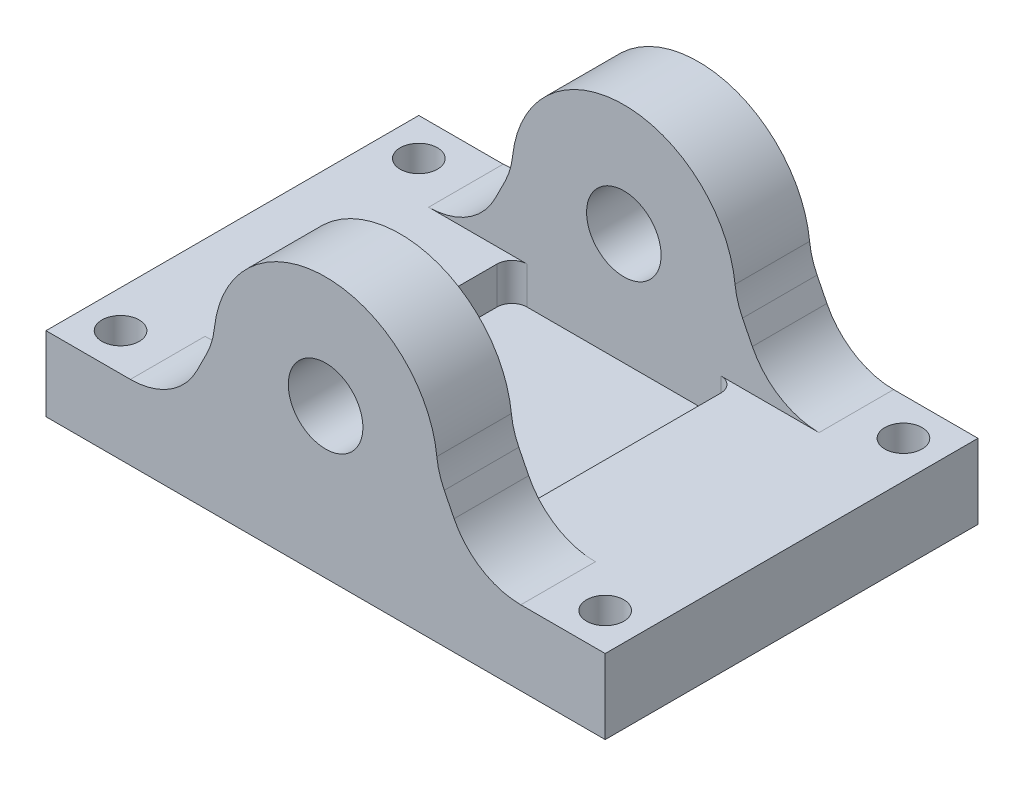
ISO-10303-21;
HEADER;
FILE_DESCRIPTION(('STEP AP214'),'2;1');
FILE_NAME('part.step','',(''),(''),'','','');
FILE_SCHEMA(('AUTOMOTIVE_DESIGN { 1 0 10303 214 1 1 1 1 }'));
ENDSEC;
DATA;
#1=APPLICATION_CONTEXT('core data for automotive mechanical design processes');
#2=APPLICATION_PROTOCOL_DEFINITION('international standard','automotive_design',2000,#1);
#3=PRODUCT_CONTEXT('',#1,'mechanical');
#4=PRODUCT('Part','Part','',(#3));
#5=PRODUCT_RELATED_PRODUCT_CATEGORY('part','',(#4));
#6=PRODUCT_DEFINITION_FORMATION('','',#4);
#7=PRODUCT_DEFINITION_CONTEXT('part definition',#1,'design');
#8=PRODUCT_DEFINITION('design','',#6,#7);
#9=PRODUCT_DEFINITION_SHAPE('','',#8);
#10=(LENGTH_UNIT() NAMED_UNIT(*) SI_UNIT(.MILLI.,.METRE.));
#11=(NAMED_UNIT(*) PLANE_ANGLE_UNIT() SI_UNIT($,.RADIAN.));
#12=(NAMED_UNIT(*) SI_UNIT($,.STERADIAN.) SOLID_ANGLE_UNIT());
#13=UNCERTAINTY_MEASURE_WITH_UNIT(LENGTH_MEASURE(1.E-05),#10,'distance_accuracy_value','');
#14=(GEOMETRIC_REPRESENTATION_CONTEXT(3) GLOBAL_UNCERTAINTY_ASSIGNED_CONTEXT((#13)) GLOBAL_UNIT_ASSIGNED_CONTEXT((#10,
#11,#12)) REPRESENTATION_CONTEXT('',''));
#15=CARTESIAN_POINT('',(0.,0.,0.));
#16=DIRECTION('',(0.,0.,1.));
#17=DIRECTION('',(1.,0.,0.));
#18=AXIS2_PLACEMENT_3D('',#15,#16,#17);
#19=CARTESIAN_POINT('',(0.,10.,0.));
#20=DIRECTION('',(0.,1.,0.));
#21=DIRECTION('',(0.,0.,1.));
#22=AXIS2_PLACEMENT_3D('',#19,#20,#21);
#23=PLANE('',#22);
#24=DIRECTION('',(0.,0.,1.));
#25=VECTOR('',#24,1.);
#26=CARTESIAN_POINT('',(22.5,10.,-40.));
#27=LINE('',#26,#25);
#28=CARTESIAN_POINT('',(22.5,10.,-38.));
#29=VERTEX_POINT('',#28);
#30=CARTESIAN_POINT('',(22.5,10.,-12.));
#31=VERTEX_POINT('',#30);
#32=EDGE_CURVE('E359',#29,#31,#27,.T.);
#33=ORIENTED_EDGE('',*,*,#32,.F.);
#34=CARTESIAN_POINT('',(24.5,10.,-38.));
#35=DIRECTION('',(0.,1.,0.));
#36=DIRECTION('',(0.,0.,1.));
#37=AXIS2_PLACEMENT_3D('',#34,#35,#36);
#38=CIRCLE('',#37,2.);
#39=CARTESIAN_POINT('',(24.5,10.,-40.));
#40=VERTEX_POINT('',#39);
#41=EDGE_CURVE('E354',#29,#40,#38,.F.);
#42=ORIENTED_EDGE('',*,*,#41,.T.);
#43=DIRECTION('',(1.,0.,0.));
#44=VECTOR('',#43,1.);
#45=CARTESIAN_POINT('',(17.5,10.,-40.));
#46=LINE('',#45,#44);
#47=CARTESIAN_POINT('',(11.319660112501,10.,-40.));
#48=VERTEX_POINT('',#47);
#49=EDGE_CURVE('E431',#48,#40,#46,.T.);
#50=ORIENTED_EDGE('',*,*,#49,.F.);
#51=DIRECTION('',(0.,0.,-1.));
#52=VECTOR('',#51,1.);
#53=CARTESIAN_POINT('',(11.319660112501,10.,0.));
#54=LINE('',#53,#52);
#55=CARTESIAN_POINT('',(11.319660112501,10.,-50.));
#56=VERTEX_POINT('',#55);
#57=EDGE_CURVE('E289',#48,#56,#54,.T.);
#58=ORIENTED_EDGE('',*,*,#57,.T.);
#59=DIRECTION('',(1.,0.,0.));
#60=VECTOR('',#59,1.);
#61=CARTESIAN_POINT('',(0.,10.,-50.));
#62=LINE('',#61,#60);
#63=CARTESIAN_POINT('',(0.,10.,-50.));
#64=VERTEX_POINT('',#63);
#65=EDGE_CURVE('E469',#64,#56,#62,.T.);
#66=ORIENTED_EDGE('',*,*,#65,.F.);
#67=DIRECTION('',(0.,0.,-1.));
#68=VECTOR('',#67,1.);
#69=CARTESIAN_POINT('',(0.,10.,0.));
#70=LINE('',#69,#68);
#71=CARTESIAN_POINT('',(0.,10.,0.));
#72=VERTEX_POINT('',#71);
#73=EDGE_CURVE('E472',#72,#64,#70,.T.);
#74=ORIENTED_EDGE('',*,*,#73,.F.);
#75=DIRECTION('',(1.,0.,0.));
#76=VECTOR('',#75,1.);
#77=CARTESIAN_POINT('',(0.,10.,0.));
#78=LINE('',#77,#76);
#79=CARTESIAN_POINT('',(11.319660112501,10.,0.));
#80=VERTEX_POINT('',#79);
#81=EDGE_CURVE('E232',#72,#80,#78,.T.);
#82=ORIENTED_EDGE('',*,*,#81,.T.);
#83=DIRECTION('',(0.,0.,1.));
#84=VECTOR('',#83,1.);
#85=CARTESIAN_POINT('',(11.319660112501,10.,-10.));
#86=LINE('',#85,#84);
#87=CARTESIAN_POINT('',(11.319660112501,10.,-10.));
#88=VERTEX_POINT('',#87);
#89=EDGE_CURVE('E258',#80,#88,#86,.F.);
#90=ORIENTED_EDGE('',*,*,#89,.T.);
#91=DIRECTION('',(1.,0.,0.));
#92=VECTOR('',#91,1.);
#93=CARTESIAN_POINT('',(17.5,10.,-10.));
#94=LINE('',#93,#92);
#95=CARTESIAN_POINT('',(24.5,10.,-10.));
#96=VERTEX_POINT('',#95);
#97=EDGE_CURVE('E50',#88,#96,#94,.T.);
#98=ORIENTED_EDGE('',*,*,#97,.T.);
#99=CARTESIAN_POINT('',(24.5,10.,-12.));
#100=DIRECTION('',(0.,1.,0.));
#101=DIRECTION('',(0.,0.,1.));
#102=AXIS2_PLACEMENT_3D('',#99,#100,#101);
#103=CIRCLE('',#102,2.);
#104=EDGE_CURVE('E43',#96,#31,#103,.F.);
#105=ORIENTED_EDGE('',*,*,#104,.T.);
#106=EDGE_LOOP('',(#33,#42,#50,#58,#66,#74,#82,#90,#98,#105));
#107=FACE_BOUND('',#106,.T.);
#108=CARTESIAN_POINT('',(5.,10.,-5.));
#109=DIRECTION('',(0.,1.,0.));
#110=DIRECTION('',(0.,0.,1.));
#111=AXIS2_PLACEMENT_3D('',#108,#109,#110);
#112=CIRCLE('',#111,2.5);
#113=CARTESIAN_POINT('',(5.,10.,-2.5));
#114=VERTEX_POINT('',#113);
#115=EDGE_CURVE('E408',#114,#114,#112,.T.);
#116=ORIENTED_EDGE('',*,*,#115,.F.);
#117=EDGE_LOOP('',(#116));
#118=FACE_BOUND('',#117,.T.);
#119=CARTESIAN_POINT('',(5.,10.,-45.));
#120=DIRECTION('',(0.,-1.,0.));
#121=DIRECTION('',(0.,0.,-1.));
#122=AXIS2_PLACEMENT_3D('',#119,#120,#121);
#123=CIRCLE('',#122,2.5);
#124=CARTESIAN_POINT('',(5.,10.,-47.5));
#125=VERTEX_POINT('',#124);
#126=EDGE_CURVE('E402',#125,#125,#123,.T.);
#127=ORIENTED_EDGE('',*,*,#126,.T.);
#128=EDGE_LOOP('',(#127));
#129=FACE_BOUND('',#128,.T.);
#130=ADVANCED_FACE('F35',(#107,#118,#129),#23,.T.);
#131=DIRECTION('',(0.,0.,-1.));
#132=VECTOR('',#131,1.);
#133=CARTESIAN_POINT('',(52.5,10.,-40.));
#134=LINE('',#133,#132);
#135=CARTESIAN_POINT('',(52.5,10.,-12.));
#136=VERTEX_POINT('',#135);
#137=CARTESIAN_POINT('',(52.5,10.,-38.));
#138=VERTEX_POINT('',#137);
#139=EDGE_CURVE('E368',#136,#138,#134,.T.);
#140=ORIENTED_EDGE('',*,*,#139,.F.);
#141=CARTESIAN_POINT('',(50.5,10.,-12.));
#142=DIRECTION('',(0.,1.,0.));
#143=DIRECTION('',(0.,0.,1.));
#144=AXIS2_PLACEMENT_3D('',#141,#142,#143);
#145=CIRCLE('',#144,2.);
#146=CARTESIAN_POINT('',(50.5,10.,-10.));
#147=VERTEX_POINT('',#146);
#148=EDGE_CURVE('E11',#136,#147,#145,.F.);
#149=ORIENTED_EDGE('',*,*,#148,.T.);
#150=CARTESIAN_POINT('',(63.680339887499,10.,-10.));
#151=VERTEX_POINT('',#150);
#152=EDGE_CURVE('E58',#147,#151,#94,.T.);
#153=ORIENTED_EDGE('',*,*,#152,.T.);
#154=DIRECTION('',(0.,0.,1.));
#155=VECTOR('',#154,1.);
#156=CARTESIAN_POINT('',(63.680339887499,10.,0.));
#157=LINE('',#156,#155);
#158=CARTESIAN_POINT('',(63.680339887499,10.,0.));
#159=VERTEX_POINT('',#158);
#160=EDGE_CURVE('E229',#151,#159,#157,.T.);
#161=ORIENTED_EDGE('',*,*,#160,.T.);
#162=CARTESIAN_POINT('',(75.,10.,0.));
#163=VERTEX_POINT('',#162);
#164=EDGE_CURVE('E220',#159,#163,#78,.T.);
#165=ORIENTED_EDGE('',*,*,#164,.T.);
#166=DIRECTION('',(0.,0.,-1.));
#167=VECTOR('',#166,1.);
#168=CARTESIAN_POINT('',(75.,10.,0.));
#169=LINE('',#168,#167);
#170=CARTESIAN_POINT('',(75.,10.,-50.));
#171=VERTEX_POINT('',#170);
#172=EDGE_CURVE('E226',#163,#171,#169,.T.);
#173=ORIENTED_EDGE('',*,*,#172,.T.);
#174=CARTESIAN_POINT('',(63.6803398874989,10.,-50.));
#175=VERTEX_POINT('',#174);
#176=EDGE_CURVE('E242',#175,#171,#62,.T.);
#177=ORIENTED_EDGE('',*,*,#176,.F.);
#178=DIRECTION('',(0.,0.,-1.));
#179=VECTOR('',#178,1.);
#180=CARTESIAN_POINT('',(63.6803398874989,10.,0.));
#181=LINE('',#180,#179);
#182=CARTESIAN_POINT('',(63.6803398874989,10.,-40.));
#183=VERTEX_POINT('',#182);
#184=EDGE_CURVE('E286',#175,#183,#181,.F.);
#185=ORIENTED_EDGE('',*,*,#184,.T.);
#186=CARTESIAN_POINT('',(50.5,10.,-40.));
#187=VERTEX_POINT('',#186);
#188=EDGE_CURVE('E430',#187,#183,#46,.T.);
#189=ORIENTED_EDGE('',*,*,#188,.F.);
#190=CARTESIAN_POINT('',(50.5,10.,-38.));
#191=DIRECTION('',(0.,1.,0.));
#192=DIRECTION('',(0.,0.,1.));
#193=AXIS2_PLACEMENT_3D('',#190,#191,#192);
#194=CIRCLE('',#193,2.);
#195=EDGE_CURVE('E352',#187,#138,#194,.F.);
#196=ORIENTED_EDGE('',*,*,#195,.T.);
#197=EDGE_LOOP('',(#140,#149,#153,#161,#165,#173,#177,#185,#189,#196));
#198=FACE_BOUND('',#197,.T.);
#199=CARTESIAN_POINT('',(70.,10.,-45.));
#200=DIRECTION('',(0.,1.,0.));
#201=DIRECTION('',(0.,0.,-1.));
#202=AXIS2_PLACEMENT_3D('',#199,#200,#201);
#203=CIRCLE('',#202,2.5);
#204=CARTESIAN_POINT('',(70.,10.,-47.5));
#205=VERTEX_POINT('',#204);
#206=EDGE_CURVE('E389',#205,#205,#203,.T.);
#207=ORIENTED_EDGE('',*,*,#206,.F.);
#208=EDGE_LOOP('',(#207));
#209=FACE_BOUND('',#208,.T.);
#210=CARTESIAN_POINT('',(70.,10.,-5.));
#211=DIRECTION('',(0.,-1.,0.));
#212=DIRECTION('',(0.,0.,1.));
#213=AXIS2_PLACEMENT_3D('',#210,#211,#212);
#214=CIRCLE('',#213,2.5);
#215=CARTESIAN_POINT('',(70.,10.,-2.5));
#216=VERTEX_POINT('',#215);
#217=EDGE_CURVE('E396',#216,#216,#214,.T.);
#218=ORIENTED_EDGE('',*,*,#217,.T.);
#219=EDGE_LOOP('',(#218));
#220=FACE_BOUND('',#219,.T.);
#221=ADVANCED_FACE('F223',(#198,#209,#220),#23,.T.);
#222=CARTESIAN_POINT('',(0.,10.,0.));
#223=DIRECTION('',(0.,0.,-1.));
#224=DIRECTION('',(-1.,0.,0.));
#225=AXIS2_PLACEMENT_3D('',#222,#223,#224);
#226=PLANE('',#225);
#227=CARTESIAN_POINT('',(37.5,20.,0.));
#228=DIRECTION('',(0.,0.,-1.));
#229=DIRECTION('',(-1.,0.,0.));
#230=AXIS2_PLACEMENT_3D('',#227,#228,#229);
#231=CIRCLE('',#230,5.);
#232=CARTESIAN_POINT('',(32.5,20.,0.));
#233=VERTEX_POINT('',#232);
#234=EDGE_CURVE('E444',#233,#233,#231,.T.);
#235=ORIENTED_EDGE('',*,*,#234,.T.);
#236=EDGE_LOOP('',(#235));
#237=FACE_BOUND('',#236,.T.);
#238=DIRECTION('',(1.,0.,0.));
#239=VECTOR('',#238,1.);
#240=CARTESIAN_POINT('',(0.,0.,0.));
#241=LINE('',#240,#239);
#242=CARTESIAN_POINT('',(0.,0.,0.));
#243=VERTEX_POINT('',#242);
#244=CARTESIAN_POINT('',(75.,0.,0.));
#245=VERTEX_POINT('',#244);
#246=EDGE_CURVE('E246',#243,#245,#241,.T.);
#247=ORIENTED_EDGE('',*,*,#246,.T.);
#248=DIRECTION('',(0.,-1.,0.));
#249=VECTOR('',#248,1.);
#250=CARTESIAN_POINT('',(75.,10.,0.));
#251=LINE('',#250,#249);
#252=EDGE_CURVE('E239',#163,#245,#251,.T.);
#253=ORIENTED_EDGE('',*,*,#252,.F.);
#254=ORIENTED_EDGE('',*,*,#164,.F.);
#255=CARTESIAN_POINT('',(63.680339887499,20.,0.));
#256=DIRECTION('',(0.,0.,-1.));
#257=DIRECTION('',(-1.,0.,0.));
#258=AXIS2_PLACEMENT_3D('',#255,#256,#257);
#259=CIRCLE('',#258,10.);
#260=CARTESIAN_POINT('',(54.7360679774998,15.5278640450004,0.));
#261=VERTEX_POINT('',#260);
#262=EDGE_CURVE('E274',#159,#261,#259,.T.);
#263=ORIENTED_EDGE('',*,*,#262,.T.);
#264=DIRECTION('',(-0.447213595499958,0.894427190999916,0.));
#265=VECTOR('',#264,1.);
#266=CARTESIAN_POINT('',(52.5,20.,0.));
#267=LINE('',#266,#265);
#268=CARTESIAN_POINT('',(53.4159122232253,18.1681755535495,0.));
#269=VERTEX_POINT('',#268);
#270=EDGE_CURVE('E454',#261,#269,#267,.T.);
#271=ORIENTED_EDGE('',*,*,#270,.T.);
#272=CARTESIAN_POINT('',(62.3601841332244,22.640311508549,0.));
#273=DIRECTION('',(0.,0.,-1.));
#274=DIRECTION('',(-1.,0.,0.));
#275=AXIS2_PLACEMENT_3D('',#272,#273,#274);
#276=CIRCLE('',#275,10.);
#277=CARTESIAN_POINT('',(52.4161104799347,21.5841869051294,0.));
#278=VERTEX_POINT('',#277);
#279=EDGE_CURVE('E282',#269,#278,#276,.T.);
#280=ORIENTED_EDGE('',*,*,#279,.T.);
#281=CARTESIAN_POINT('',(37.5,20.,0.));
#282=DIRECTION('',(0.,0.,1.));
#283=DIRECTION('',(1.,0.,0.));
#284=AXIS2_PLACEMENT_3D('',#281,#282,#283);
#285=CIRCLE('',#284,15.);
#286=CARTESIAN_POINT('',(22.5838895200653,21.5841869051294,0.));
#287=VERTEX_POINT('',#286);
#288=EDGE_CURVE('E447',#278,#287,#285,.T.);
#289=ORIENTED_EDGE('',*,*,#288,.T.);
#290=CARTESIAN_POINT('',(12.6398158667756,22.6403115085491,0.));
#291=DIRECTION('',(0.,0.,-1.));
#292=DIRECTION('',(-1.,0.,0.));
#293=AXIS2_PLACEMENT_3D('',#290,#291,#292);
#294=CIRCLE('',#293,10.);
#295=CARTESIAN_POINT('',(21.5840877767747,18.1681755535495,0.));
#296=VERTEX_POINT('',#295);
#297=EDGE_CURVE('E278',#287,#296,#294,.T.);
#298=ORIENTED_EDGE('',*,*,#297,.T.);
#299=DIRECTION('',(-0.447213595499958,-0.894427190999916,0.));
#300=VECTOR('',#299,1.);
#301=CARTESIAN_POINT('',(22.5,20.,0.));
#302=LINE('',#301,#300);
#303=CARTESIAN_POINT('',(20.2639320225002,15.5278640450004,0.));
#304=VERTEX_POINT('',#303);
#305=EDGE_CURVE('E463',#296,#304,#302,.T.);
#306=ORIENTED_EDGE('',*,*,#305,.T.);
#307=CARTESIAN_POINT('',(11.319660112501,20.,0.));
#308=DIRECTION('',(0.,0.,-1.));
#309=DIRECTION('',(-1.,0.,0.));
#310=AXIS2_PLACEMENT_3D('',#307,#308,#309);
#311=CIRCLE('',#310,10.);
#312=EDGE_CURVE('E270',#304,#80,#311,.T.);
#313=ORIENTED_EDGE('',*,*,#312,.T.);
#314=ORIENTED_EDGE('',*,*,#81,.F.);
#315=DIRECTION('',(0.,-1.,0.));
#316=VECTOR('',#315,1.);
#317=CARTESIAN_POINT('',(0.,10.,0.));
#318=LINE('',#317,#316);
#319=EDGE_CURVE('E475',#72,#243,#318,.T.);
#320=ORIENTED_EDGE('',*,*,#319,.T.);
#321=EDGE_LOOP('',(#247,#253,#254,#263,#271,#280,#289,#298,#306,#313,#314,#320));
#322=FACE_BOUND('',#321,.T.);
#323=ADVANCED_FACE('F244',(#237,#322),#226,.F.);
#324=CARTESIAN_POINT('',(75.,10.,0.));
#325=DIRECTION('',(-1.,0.,0.));
#326=DIRECTION('',(0.,0.,1.));
#327=AXIS2_PLACEMENT_3D('',#324,#325,#326);
#328=PLANE('',#327);
#329=DIRECTION('',(0.,0.,-1.));
#330=VECTOR('',#329,1.);
#331=CARTESIAN_POINT('',(75.,0.,0.));
#332=LINE('',#331,#330);
#333=CARTESIAN_POINT('',(75.,0.,-50.));
#334=VERTEX_POINT('',#333);
#335=EDGE_CURVE('E477',#245,#334,#332,.T.);
#336=ORIENTED_EDGE('',*,*,#335,.T.);
#337=DIRECTION('',(0.,-1.,0.));
#338=VECTOR('',#337,1.);
#339=CARTESIAN_POINT('',(75.,10.,-50.));
#340=LINE('',#339,#338);
#341=EDGE_CURVE('E241',#171,#334,#340,.T.);
#342=ORIENTED_EDGE('',*,*,#341,.F.);
#343=ORIENTED_EDGE('',*,*,#172,.F.);
#344=ORIENTED_EDGE('',*,*,#252,.T.);
#345=EDGE_LOOP('',(#336,#342,#343,#344));
#346=FACE_BOUND('',#345,.T.);
#347=ADVANCED_FACE('F238',(#346),#328,.F.);
#348=CARTESIAN_POINT('',(0.,10.,-50.));
#349=DIRECTION('',(0.,0.,-1.));
#350=DIRECTION('',(-1.,0.,0.));
#351=AXIS2_PLACEMENT_3D('',#348,#349,#350);
#352=PLANE('',#351);
#353=CARTESIAN_POINT('',(37.5,20.,-50.));
#354=DIRECTION('',(0.,0.,-1.));
#355=DIRECTION('',(-1.,0.,0.));
#356=AXIS2_PLACEMENT_3D('',#353,#354,#355);
#357=CIRCLE('',#356,5.);
#358=CARTESIAN_POINT('',(32.5,20.,-50.));
#359=VERTEX_POINT('',#358);
#360=EDGE_CURVE('E417',#359,#359,#357,.T.);
#361=ORIENTED_EDGE('',*,*,#360,.F.);
#362=EDGE_LOOP('',(#361));
#363=FACE_BOUND('',#362,.T.);
#364=DIRECTION('',(1.,0.,0.));
#365=VECTOR('',#364,1.);
#366=CARTESIAN_POINT('',(0.,0.,-50.));
#367=LINE('',#366,#365);
#368=CARTESIAN_POINT('',(0.,0.,-50.));
#369=VERTEX_POINT('',#368);
#370=EDGE_CURVE('E479',#369,#334,#367,.T.);
#371=ORIENTED_EDGE('',*,*,#370,.F.);
#372=DIRECTION('',(0.,-1.,0.));
#373=VECTOR('',#372,1.);
#374=CARTESIAN_POINT('',(0.,10.,-50.));
#375=LINE('',#374,#373);
#376=EDGE_CURVE('E251',#64,#369,#375,.T.);
#377=ORIENTED_EDGE('',*,*,#376,.F.);
#378=ORIENTED_EDGE('',*,*,#65,.T.);
#379=CARTESIAN_POINT('',(11.319660112501,20.,-50.));
#380=DIRECTION('',(0.,0.,-1.));
#381=DIRECTION('',(-1.,0.,0.));
#382=AXIS2_PLACEMENT_3D('',#379,#380,#381);
#383=CIRCLE('',#382,10.);
#384=CARTESIAN_POINT('',(20.2639320225002,15.5278640450004,-50.));
#385=VERTEX_POINT('',#384);
#386=EDGE_CURVE('E307',#56,#385,#383,.F.);
#387=ORIENTED_EDGE('',*,*,#386,.T.);
#388=DIRECTION('',(-0.447213595499958,-0.894427190999916,0.));
#389=VECTOR('',#388,1.);
#390=CARTESIAN_POINT('',(22.5,20.,-50.));
#391=LINE('',#390,#389);
#392=CARTESIAN_POINT('',(21.5840877767747,18.1681755535495,-50.));
#393=VERTEX_POINT('',#392);
#394=EDGE_CURVE('E427',#393,#385,#391,.T.);
#395=ORIENTED_EDGE('',*,*,#394,.F.);
#396=CARTESIAN_POINT('',(12.6398158667756,22.6403115085491,-50.));
#397=DIRECTION('',(0.,0.,-1.));
#398=DIRECTION('',(-1.,0.,0.));
#399=AXIS2_PLACEMENT_3D('',#396,#397,#398);
#400=CIRCLE('',#399,10.);
#401=CARTESIAN_POINT('',(22.5838895200653,21.5841869051294,-50.));
#402=VERTEX_POINT('',#401);
#403=EDGE_CURVE('E316',#393,#402,#400,.F.);
#404=ORIENTED_EDGE('',*,*,#403,.T.);
#405=CARTESIAN_POINT('',(37.5,20.,-50.));
#406=DIRECTION('',(0.,0.,1.));
#407=DIRECTION('',(1.,0.,0.));
#408=AXIS2_PLACEMENT_3D('',#405,#406,#407);
#409=CIRCLE('',#408,15.);
#410=CARTESIAN_POINT('',(52.4161104799347,21.5841869051294,-50.));
#411=VERTEX_POINT('',#410);
#412=EDGE_CURVE('E420',#411,#402,#409,.T.);
#413=ORIENTED_EDGE('',*,*,#412,.F.);
#414=CARTESIAN_POINT('',(62.3601841332244,22.640311508549,-50.));
#415=DIRECTION('',(0.,0.,-1.));
#416=DIRECTION('',(-1.,0.,0.));
#417=AXIS2_PLACEMENT_3D('',#414,#415,#416);
#418=CIRCLE('',#417,10.);
#419=CARTESIAN_POINT('',(53.4159122232253,18.1681755535495,-50.));
#420=VERTEX_POINT('',#419);
#421=EDGE_CURVE('E320',#411,#420,#418,.F.);
#422=ORIENTED_EDGE('',*,*,#421,.T.);
#423=DIRECTION('',(-0.447213595499958,0.894427190999916,0.));
#424=VECTOR('',#423,1.);
#425=CARTESIAN_POINT('',(52.5,20.,-50.));
#426=LINE('',#425,#424);
#427=CARTESIAN_POINT('',(54.7360679774998,15.5278640450004,-50.));
#428=VERTEX_POINT('',#427);
#429=EDGE_CURVE('E439',#428,#420,#426,.T.);
#430=ORIENTED_EDGE('',*,*,#429,.F.);
#431=CARTESIAN_POINT('',(63.6803398874989,20.,-50.));
#432=DIRECTION('',(0.,0.,-1.));
#433=DIRECTION('',(-1.,0.,0.));
#434=AXIS2_PLACEMENT_3D('',#431,#432,#433);
#435=CIRCLE('',#434,10.);
#436=EDGE_CURVE('E312',#428,#175,#435,.F.);
#437=ORIENTED_EDGE('',*,*,#436,.T.);
#438=ORIENTED_EDGE('',*,*,#176,.T.);
#439=ORIENTED_EDGE('',*,*,#341,.T.);
#440=EDGE_LOOP('',(#371,#377,#378,#387,#395,#404,#413,#422,#430,#437,#438,#439));
#441=FACE_BOUND('',#440,.T.);
#442=ADVANCED_FACE('F491',(#363,#441),#352,.T.);
#443=CARTESIAN_POINT('',(0.,10.,0.));
#444=DIRECTION('',(-1.,0.,0.));
#445=DIRECTION('',(0.,0.,1.));
#446=AXIS2_PLACEMENT_3D('',#443,#444,#445);
#447=PLANE('',#446);
#448=DIRECTION('',(0.,0.,-1.));
#449=VECTOR('',#448,1.);
#450=CARTESIAN_POINT('',(0.,0.,0.));
#451=LINE('',#450,#449);
#452=EDGE_CURVE('E233',#243,#369,#451,.T.);
#453=ORIENTED_EDGE('',*,*,#452,.F.);
#454=ORIENTED_EDGE('',*,*,#319,.F.);
#455=ORIENTED_EDGE('',*,*,#73,.T.);
#456=ORIENTED_EDGE('',*,*,#376,.T.);
#457=EDGE_LOOP('',(#453,#454,#455,#456));
#458=FACE_BOUND('',#457,.T.);
#459=ADVANCED_FACE('F487',(#458),#447,.T.);
#460=CARTESIAN_POINT('',(0.,0.,0.));
#461=DIRECTION('',(0.,1.,0.));
#462=DIRECTION('',(0.,0.,1.));
#463=AXIS2_PLACEMENT_3D('',#460,#461,#462);
#464=PLANE('',#463);
#465=CARTESIAN_POINT('',(70.,0.,-45.));
#466=DIRECTION('',(0.,1.,0.));
#467=DIRECTION('',(0.,0.,-1.));
#468=AXIS2_PLACEMENT_3D('',#465,#466,#467);
#469=CIRCLE('',#468,2.5);
#470=CARTESIAN_POINT('',(70.,0.,-47.5));
#471=VERTEX_POINT('',#470);
#472=EDGE_CURVE('E393',#471,#471,#469,.T.);
#473=ORIENTED_EDGE('',*,*,#472,.T.);
#474=EDGE_LOOP('',(#473));
#475=FACE_BOUND('',#474,.T.);
#476=CARTESIAN_POINT('',(70.,0.,-5.));
#477=DIRECTION('',(0.,-1.,0.));
#478=DIRECTION('',(0.,0.,1.));
#479=AXIS2_PLACEMENT_3D('',#476,#477,#478);
#480=CIRCLE('',#479,2.5);
#481=CARTESIAN_POINT('',(70.,0.,-2.5));
#482=VERTEX_POINT('',#481);
#483=EDGE_CURVE('E399',#482,#482,#480,.T.);
#484=ORIENTED_EDGE('',*,*,#483,.F.);
#485=EDGE_LOOP('',(#484));
#486=FACE_BOUND('',#485,.T.);
#487=CARTESIAN_POINT('',(5.,0.,-45.));
#488=DIRECTION('',(0.,-1.,0.));
#489=DIRECTION('',(0.,0.,-1.));
#490=AXIS2_PLACEMENT_3D('',#487,#488,#489);
#491=CIRCLE('',#490,2.5);
#492=CARTESIAN_POINT('',(5.,0.,-47.5));
#493=VERTEX_POINT('',#492);
#494=EDGE_CURVE('E405',#493,#493,#491,.T.);
#495=ORIENTED_EDGE('',*,*,#494,.F.);
#496=EDGE_LOOP('',(#495));
#497=FACE_BOUND('',#496,.T.);
#498=CARTESIAN_POINT('',(5.,0.,-5.));
#499=DIRECTION('',(0.,1.,0.));
#500=DIRECTION('',(0.,0.,1.));
#501=AXIS2_PLACEMENT_3D('',#498,#499,#500);
#502=CIRCLE('',#501,2.5);
#503=CARTESIAN_POINT('',(5.,0.,-2.5));
#504=VERTEX_POINT('',#503);
#505=EDGE_CURVE('E411',#504,#504,#502,.T.);
#506=ORIENTED_EDGE('',*,*,#505,.T.);
#507=EDGE_LOOP('',(#506));
#508=FACE_BOUND('',#507,.T.);
#509=ORIENTED_EDGE('',*,*,#246,.F.);
#510=ORIENTED_EDGE('',*,*,#452,.T.);
#511=ORIENTED_EDGE('',*,*,#370,.T.);
#512=ORIENTED_EDGE('',*,*,#335,.F.);
#513=EDGE_LOOP('',(#509,#510,#511,#512));
#514=FACE_BOUND('',#513,.T.);
#515=ADVANCED_FACE('F493',(#475,#486,#497,#508,#514),#464,.F.);
#516=CARTESIAN_POINT('',(37.5,20.,-10.));
#517=DIRECTION('',(0.,0.,1.));
#518=DIRECTION('',(1.,0.,0.));
#519=AXIS2_PLACEMENT_3D('',#516,#517,#518);
#520=CYLINDRICAL_SURFACE('',#519,15.);
#521=CARTESIAN_POINT('',(37.5,20.,-10.));
#522=DIRECTION('',(0.,0.,1.));
#523=DIRECTION('',(1.,0.,0.));
#524=AXIS2_PLACEMENT_3D('',#521,#522,#523);
#525=CIRCLE('',#524,15.);
#526=CARTESIAN_POINT('',(52.4161104799347,21.5841869051294,-10.));
#527=VERTEX_POINT('',#526);
#528=CARTESIAN_POINT('',(22.5838895200653,21.5841869051294,-10.));
#529=VERTEX_POINT('',#528);
#530=EDGE_CURVE('E450',#527,#529,#525,.T.);
#531=ORIENTED_EDGE('',*,*,#530,.T.);
#532=DIRECTION('',(0.,0.,1.));
#533=VECTOR('',#532,1.);
#534=CARTESIAN_POINT('',(22.5838895200653,21.5841869051294,-10.));
#535=LINE('',#534,#533);
#536=EDGE_CURVE('E267',#529,#287,#535,.T.);
#537=ORIENTED_EDGE('',*,*,#536,.T.);
#538=ORIENTED_EDGE('',*,*,#288,.F.);
#539=DIRECTION('',(0.,0.,1.));
#540=VECTOR('',#539,1.);
#541=CARTESIAN_POINT('',(52.4161104799347,21.5841869051294,-10.));
#542=LINE('',#541,#540);
#543=EDGE_CURVE('E265',#278,#527,#542,.F.);
#544=ORIENTED_EDGE('',*,*,#543,.T.);
#545=EDGE_LOOP('',(#531,#537,#538,#544));
#546=FACE_BOUND('',#545,.T.);
#547=ADVANCED_FACE('F495',(#546),#520,.T.);
#548=CARTESIAN_POINT('',(52.5,20.,-10.));
#549=DIRECTION('',(0.894427190999916,0.447213595499958,0.));
#550=DIRECTION('',(-0.447213595499958,0.894427190999916,0.));
#551=AXIS2_PLACEMENT_3D('',#548,#549,#550);
#552=PLANE('',#551);
#553=ORIENTED_EDGE('',*,*,#270,.F.);
#554=DIRECTION('',(0.,0.,1.));
#555=VECTOR('',#554,1.);
#556=CARTESIAN_POINT('',(54.7360679774998,15.5278640450004,-10.));
#557=LINE('',#556,#555);
#558=CARTESIAN_POINT('',(54.7360679774998,15.5278640450004,-10.));
#559=VERTEX_POINT('',#558);
#560=EDGE_CURVE('E263',#261,#559,#557,.F.);
#561=ORIENTED_EDGE('',*,*,#560,.T.);
#562=DIRECTION('',(-0.447213595499958,0.894427190999916,0.));
#563=VECTOR('',#562,1.);
#564=CARTESIAN_POINT('',(52.5,20.,-10.));
#565=LINE('',#564,#563);
#566=CARTESIAN_POINT('',(53.4159122232253,18.1681755535495,-10.));
#567=VERTEX_POINT('',#566);
#568=EDGE_CURVE('E458',#559,#567,#565,.T.);
#569=ORIENTED_EDGE('',*,*,#568,.T.);
#570=DIRECTION('',(0.,0.,-1.));
#571=VECTOR('',#570,1.);
#572=CARTESIAN_POINT('',(53.4159122232253,18.1681755535495,0.));
#573=LINE('',#572,#571);
#574=EDGE_CURVE('E260',#567,#269,#573,.F.);
#575=ORIENTED_EDGE('',*,*,#574,.T.);
#576=EDGE_LOOP('',(#553,#561,#569,#575));
#577=FACE_BOUND('',#576,.T.);
#578=ADVANCED_FACE('F502',(#577),#552,.T.);
#579=CARTESIAN_POINT('',(22.5,20.,-10.));
#580=DIRECTION('',(-0.894427190999916,0.447213595499958,0.));
#581=DIRECTION('',(-0.447213595499958,-0.894427190999916,0.));
#582=AXIS2_PLACEMENT_3D('',#579,#580,#581);
#583=PLANE('',#582);
#584=DIRECTION('',(-0.447213595499958,-0.894427190999916,0.));
#585=VECTOR('',#584,1.);
#586=CARTESIAN_POINT('',(22.5,20.,-10.));
#587=LINE('',#586,#585);
#588=CARTESIAN_POINT('',(21.5840877767747,18.1681755535495,-10.));
#589=VERTEX_POINT('',#588);
#590=CARTESIAN_POINT('',(20.2639320225002,15.5278640450004,-10.));
#591=VERTEX_POINT('',#590);
#592=EDGE_CURVE('E453',#589,#591,#587,.T.);
#593=ORIENTED_EDGE('',*,*,#592,.T.);
#594=DIRECTION('',(0.,0.,1.));
#595=VECTOR('',#594,1.);
#596=CARTESIAN_POINT('',(20.2639320225002,15.5278640450004,0.));
#597=LINE('',#596,#595);
#598=EDGE_CURVE('E249',#591,#304,#597,.T.);
#599=ORIENTED_EDGE('',*,*,#598,.T.);
#600=ORIENTED_EDGE('',*,*,#305,.F.);
#601=DIRECTION('',(0.,0.,-1.));
#602=VECTOR('',#601,1.);
#603=CARTESIAN_POINT('',(21.5840877767747,18.1681755535495,-10.));
#604=LINE('',#603,#602);
#605=EDGE_CURVE('E247',#296,#589,#604,.T.);
#606=ORIENTED_EDGE('',*,*,#605,.T.);
#607=EDGE_LOOP('',(#593,#599,#600,#606));
#608=FACE_BOUND('',#607,.T.);
#609=ADVANCED_FACE('F513',(#608),#583,.T.);
#610=CARTESIAN_POINT('',(37.5,20.,-10.));
#611=DIRECTION('',(0.,0.,1.));
#612=DIRECTION('',(1.,0.,0.));
#613=AXIS2_PLACEMENT_3D('',#610,#611,#612);
#614=PLANE('',#613);
#615=CARTESIAN_POINT('',(37.5,20.,-10.));
#616=DIRECTION('',(0.,0.,-1.));
#617=DIRECTION('',(-1.,0.,0.));
#618=AXIS2_PLACEMENT_3D('',#615,#616,#617);
#619=CIRCLE('',#618,5.);
#620=CARTESIAN_POINT('',(32.5,20.,-10.));
#621=VERTEX_POINT('',#620);
#622=EDGE_CURVE('E436',#621,#621,#619,.T.);
#623=ORIENTED_EDGE('',*,*,#622,.F.);
#624=EDGE_LOOP('',(#623));
#625=FACE_BOUND('',#624,.T.);
#626=DIRECTION('',(1.,0.,0.));
#627=VECTOR('',#626,1.);
#628=CARTESIAN_POINT('',(22.5,5.,-10.));
#629=LINE('',#628,#627);
#630=CARTESIAN_POINT('',(24.5,5.,-10.));
#631=VERTEX_POINT('',#630);
#632=CARTESIAN_POINT('',(50.5,5.,-10.));
#633=VERTEX_POINT('',#632);
#634=EDGE_CURVE('E377',#631,#633,#629,.T.);
#635=ORIENTED_EDGE('',*,*,#634,.F.);
#636=DIRECTION('',(0.,1.,0.));
#637=VECTOR('',#636,1.);
#638=CARTESIAN_POINT('',(24.5,10.,-10.));
#639=LINE('',#638,#637);
#640=EDGE_CURVE('E349',#631,#96,#639,.T.);
#641=ORIENTED_EDGE('',*,*,#640,.T.);
#642=ORIENTED_EDGE('',*,*,#97,.F.);
#643=CARTESIAN_POINT('',(11.319660112501,20.,-10.));
#644=DIRECTION('',(0.,0.,1.));
#645=DIRECTION('',(1.,0.,0.));
#646=AXIS2_PLACEMENT_3D('',#643,#644,#645);
#647=CIRCLE('',#646,10.);
#648=EDGE_CURVE('E272',#88,#591,#647,.T.);
#649=ORIENTED_EDGE('',*,*,#648,.T.);
#650=ORIENTED_EDGE('',*,*,#592,.F.);
#651=CARTESIAN_POINT('',(12.6398158667756,22.6403115085491,-10.));
#652=DIRECTION('',(0.,0.,1.));
#653=DIRECTION('',(1.,0.,0.));
#654=AXIS2_PLACEMENT_3D('',#651,#652,#653);
#655=CIRCLE('',#654,10.);
#656=EDGE_CURVE('E280',#589,#529,#655,.T.);
#657=ORIENTED_EDGE('',*,*,#656,.T.);
#658=ORIENTED_EDGE('',*,*,#530,.F.);
#659=CARTESIAN_POINT('',(62.3601841332244,22.640311508549,-10.));
#660=DIRECTION('',(0.,0.,1.));
#661=DIRECTION('',(1.,0.,0.));
#662=AXIS2_PLACEMENT_3D('',#659,#660,#661);
#663=CIRCLE('',#662,10.);
#664=EDGE_CURVE('E284',#527,#567,#663,.T.);
#665=ORIENTED_EDGE('',*,*,#664,.T.);
#666=ORIENTED_EDGE('',*,*,#568,.F.);
#667=CARTESIAN_POINT('',(63.680339887499,20.,-10.));
#668=DIRECTION('',(0.,0.,1.));
#669=DIRECTION('',(1.,0.,0.));
#670=AXIS2_PLACEMENT_3D('',#667,#668,#669);
#671=CIRCLE('',#670,10.);
#672=EDGE_CURVE('E276',#559,#151,#671,.T.);
#673=ORIENTED_EDGE('',*,*,#672,.T.);
#674=ORIENTED_EDGE('',*,*,#152,.F.);
#675=DIRECTION('',(0.,1.,0.));
#676=VECTOR('',#675,1.);
#677=CARTESIAN_POINT('',(50.5,5.,-10.));
#678=LINE('',#677,#676);
#679=EDGE_CURVE('E347',#147,#633,#678,.F.);
#680=ORIENTED_EDGE('',*,*,#679,.T.);
#681=EDGE_LOOP('',(#635,#641,#642,#649,#650,#657,#658,#665,#666,#673,#674,#680));
#682=FACE_BOUND('',#681,.T.);
#683=ADVANCED_FACE('F380',(#625,#682),#614,.F.);
#684=CARTESIAN_POINT('',(11.319660112501,20.,-10.));
#685=DIRECTION('',(0.,0.,-1.));
#686=DIRECTION('',(-1.,0.,0.));
#687=AXIS2_PLACEMENT_3D('',#684,#685,#686);
#688=CYLINDRICAL_SURFACE('',#687,10.);
#689=ORIENTED_EDGE('',*,*,#648,.F.);
#690=ORIENTED_EDGE('',*,*,#89,.F.);
#691=ORIENTED_EDGE('',*,*,#312,.F.);
#692=ORIENTED_EDGE('',*,*,#598,.F.);
#693=EDGE_LOOP('',(#689,#690,#691,#692));
#694=FACE_BOUND('',#693,.T.);
#695=ADVANCED_FACE('F522',(#694),#688,.F.);
#696=CARTESIAN_POINT('',(63.680339887499,20.,0.));
#697=DIRECTION('',(0.,0.,-1.));
#698=DIRECTION('',(-1.,0.,0.));
#699=AXIS2_PLACEMENT_3D('',#696,#697,#698);
#700=CYLINDRICAL_SURFACE('',#699,10.);
#701=ORIENTED_EDGE('',*,*,#672,.F.);
#702=ORIENTED_EDGE('',*,*,#560,.F.);
#703=ORIENTED_EDGE('',*,*,#262,.F.);
#704=ORIENTED_EDGE('',*,*,#160,.F.);
#705=EDGE_LOOP('',(#701,#702,#703,#704));
#706=FACE_BOUND('',#705,.T.);
#707=ADVANCED_FACE('F633',(#706),#700,.F.);
#708=CARTESIAN_POINT('',(12.6398158667756,22.6403115085491,-10.));
#709=DIRECTION('',(0.,0.,1.));
#710=DIRECTION('',(1.,0.,0.));
#711=AXIS2_PLACEMENT_3D('',#708,#709,#710);
#712=CYLINDRICAL_SURFACE('',#711,10.);
#713=ORIENTED_EDGE('',*,*,#656,.F.);
#714=ORIENTED_EDGE('',*,*,#605,.F.);
#715=ORIENTED_EDGE('',*,*,#297,.F.);
#716=ORIENTED_EDGE('',*,*,#536,.F.);
#717=EDGE_LOOP('',(#713,#714,#715,#716));
#718=FACE_BOUND('',#717,.T.);
#719=ADVANCED_FACE('F644',(#718),#712,.F.);
#720=CARTESIAN_POINT('',(62.3601841332244,22.640311508549,-10.));
#721=DIRECTION('',(0.,0.,1.));
#722=DIRECTION('',(1.,0.,0.));
#723=AXIS2_PLACEMENT_3D('',#720,#721,#722);
#724=CYLINDRICAL_SURFACE('',#723,10.);
#725=ORIENTED_EDGE('',*,*,#664,.F.);
#726=ORIENTED_EDGE('',*,*,#543,.F.);
#727=ORIENTED_EDGE('',*,*,#279,.F.);
#728=ORIENTED_EDGE('',*,*,#574,.F.);
#729=EDGE_LOOP('',(#725,#726,#727,#728));
#730=FACE_BOUND('',#729,.T.);
#731=ADVANCED_FACE('F528',(#730),#724,.F.);
#732=CARTESIAN_POINT('',(37.5,20.,0.));
#733=DIRECTION('',(0.,0.,-1.));
#734=DIRECTION('',(-1.,0.,0.));
#735=AXIS2_PLACEMENT_3D('',#732,#733,#734);
#736=CYLINDRICAL_SURFACE('',#735,5.);
#737=ORIENTED_EDGE('',*,*,#234,.F.);
#738=EDGE_LOOP('',(#737));
#739=FACE_BOUND('',#738,.T.);
#740=ORIENTED_EDGE('',*,*,#622,.T.);
#741=EDGE_LOOP('',(#740));
#742=FACE_BOUND('',#741,.T.);
#743=ADVANCED_FACE('F524',(#739,#742),#736,.F.);
#744=CARTESIAN_POINT('',(37.5,20.,-40.));
#745=DIRECTION('',(0.,0.,-1.));
#746=DIRECTION('',(-1.,0.,0.));
#747=AXIS2_PLACEMENT_3D('',#744,#745,#746);
#748=CYLINDRICAL_SURFACE('',#747,15.);
#749=ORIENTED_EDGE('',*,*,#412,.T.);
#750=DIRECTION('',(0.,0.,-1.));
#751=VECTOR('',#750,1.);
#752=CARTESIAN_POINT('',(22.5838895200653,21.5841869051294,-40.));
#753=LINE('',#752,#751);
#754=CARTESIAN_POINT('',(22.5838895200653,21.5841869051294,-40.));
#755=VERTEX_POINT('',#754);
#756=EDGE_CURVE('E305',#402,#755,#753,.F.);
#757=ORIENTED_EDGE('',*,*,#756,.T.);
#758=CARTESIAN_POINT('',(37.5,20.,-40.));
#759=DIRECTION('',(0.,0.,1.));
#760=DIRECTION('',(1.,0.,0.));
#761=AXIS2_PLACEMENT_3D('',#758,#759,#760);
#762=CIRCLE('',#761,15.);
#763=CARTESIAN_POINT('',(52.4161104799347,21.5841869051294,-40.));
#764=VERTEX_POINT('',#763);
#765=EDGE_CURVE('E423',#764,#755,#762,.T.);
#766=ORIENTED_EDGE('',*,*,#765,.F.);
#767=DIRECTION('',(0.,0.,-1.));
#768=VECTOR('',#767,1.);
#769=CARTESIAN_POINT('',(52.4161104799347,21.5841869051294,-40.));
#770=LINE('',#769,#768);
#771=EDGE_CURVE('E302',#764,#411,#770,.T.);
#772=ORIENTED_EDGE('',*,*,#771,.T.);
#773=EDGE_LOOP('',(#749,#757,#766,#772));
#774=FACE_BOUND('',#773,.T.);
#775=ADVANCED_FACE('F527',(#774),#748,.T.);
#776=CARTESIAN_POINT('',(22.5,20.,-40.));
#777=DIRECTION('',(0.894427190999916,-0.447213595499958,0.));
#778=DIRECTION('',(0.447213595499958,0.894427190999916,0.));
#779=AXIS2_PLACEMENT_3D('',#776,#777,#778);
#780=PLANE('',#779);
#781=ORIENTED_EDGE('',*,*,#394,.T.);
#782=DIRECTION('',(0.,0.,-1.));
#783=VECTOR('',#782,1.);
#784=CARTESIAN_POINT('',(20.2639320225002,15.5278640450004,-40.));
#785=LINE('',#784,#783);
#786=CARTESIAN_POINT('',(20.2639320225002,15.5278640450004,-40.));
#787=VERTEX_POINT('',#786);
#788=EDGE_CURVE('E295',#385,#787,#785,.F.);
#789=ORIENTED_EDGE('',*,*,#788,.T.);
#790=DIRECTION('',(-0.447213595499958,-0.894427190999916,0.));
#791=VECTOR('',#790,1.);
#792=CARTESIAN_POINT('',(22.5,20.,-40.));
#793=LINE('',#792,#791);
#794=CARTESIAN_POINT('',(21.5840877767747,18.1681755535495,-40.));
#795=VERTEX_POINT('',#794);
#796=EDGE_CURVE('E433',#795,#787,#793,.T.);
#797=ORIENTED_EDGE('',*,*,#796,.F.);
#798=DIRECTION('',(0.,0.,1.));
#799=VECTOR('',#798,1.);
#800=CARTESIAN_POINT('',(21.5840877767747,18.1681755535495,-50.));
#801=LINE('',#800,#799);
#802=EDGE_CURVE('E292',#795,#393,#801,.F.);
#803=ORIENTED_EDGE('',*,*,#802,.T.);
#804=EDGE_LOOP('',(#781,#789,#797,#803));
#805=FACE_BOUND('',#804,.T.);
#806=ADVANCED_FACE('F532',(#805),#780,.F.);
#807=CARTESIAN_POINT('',(52.5,20.,-40.));
#808=DIRECTION('',(-0.894427190999916,-0.447213595499958,0.));
#809=DIRECTION('',(0.447213595499958,-0.894427190999916,0.));
#810=AXIS2_PLACEMENT_3D('',#807,#808,#809);
#811=PLANE('',#810);
#812=DIRECTION('',(-0.447213595499958,0.894427190999916,0.));
#813=VECTOR('',#812,1.);
#814=CARTESIAN_POINT('',(52.5,20.,-40.));
#815=LINE('',#814,#813);
#816=CARTESIAN_POINT('',(54.7360679774998,15.5278640450004,-40.));
#817=VERTEX_POINT('',#816);
#818=CARTESIAN_POINT('',(53.4159122232253,18.1681755535495,-40.));
#819=VERTEX_POINT('',#818);
#820=EDGE_CURVE('E426',#817,#819,#815,.T.);
#821=ORIENTED_EDGE('',*,*,#820,.F.);
#822=DIRECTION('',(0.,0.,-1.));
#823=VECTOR('',#822,1.);
#824=CARTESIAN_POINT('',(54.7360679774998,15.5278640450004,-40.));
#825=LINE('',#824,#823);
#826=EDGE_CURVE('E299',#817,#428,#825,.T.);
#827=ORIENTED_EDGE('',*,*,#826,.T.);
#828=ORIENTED_EDGE('',*,*,#429,.T.);
#829=DIRECTION('',(0.,0.,1.));
#830=VECTOR('',#829,1.);
#831=CARTESIAN_POINT('',(53.4159122232253,18.1681755535495,-40.));
#832=LINE('',#831,#830);
#833=EDGE_CURVE('E297',#420,#819,#832,.T.);
#834=ORIENTED_EDGE('',*,*,#833,.T.);
#835=EDGE_LOOP('',(#821,#827,#828,#834));
#836=FACE_BOUND('',#835,.T.);
#837=ADVANCED_FACE('F534',(#836),#811,.F.);
#838=CARTESIAN_POINT('',(37.5,20.,-40.));
#839=DIRECTION('',(0.,0.,-1.));
#840=DIRECTION('',(1.,0.,0.));
#841=AXIS2_PLACEMENT_3D('',#838,#839,#840);
#842=PLANE('',#841);
#843=CARTESIAN_POINT('',(37.5,20.,-40.));
#844=DIRECTION('',(0.,0.,-1.));
#845=DIRECTION('',(-1.,0.,0.));
#846=AXIS2_PLACEMENT_3D('',#843,#844,#845);
#847=CIRCLE('',#846,5.);
#848=CARTESIAN_POINT('',(32.5,20.,-40.));
#849=VERTEX_POINT('',#848);
#850=EDGE_CURVE('E414',#849,#849,#847,.T.);
#851=ORIENTED_EDGE('',*,*,#850,.T.);
#852=EDGE_LOOP('',(#851));
#853=FACE_BOUND('',#852,.T.);
#854=DIRECTION('',(-1.,0.,0.));
#855=VECTOR('',#854,1.);
#856=CARTESIAN_POINT('',(22.5,5.,-40.));
#857=LINE('',#856,#855);
#858=CARTESIAN_POINT('',(50.5,5.,-40.));
#859=VERTEX_POINT('',#858);
#860=CARTESIAN_POINT('',(24.5,5.,-40.));
#861=VERTEX_POINT('',#860);
#862=EDGE_CURVE('E384',#859,#861,#857,.T.);
#863=ORIENTED_EDGE('',*,*,#862,.F.);
#864=DIRECTION('',(0.,1.,0.));
#865=VECTOR('',#864,1.);
#866=CARTESIAN_POINT('',(50.5,10.,-40.));
#867=LINE('',#866,#865);
#868=EDGE_CURVE('E326',#859,#187,#867,.T.);
#869=ORIENTED_EDGE('',*,*,#868,.T.);
#870=ORIENTED_EDGE('',*,*,#188,.T.);
#871=CARTESIAN_POINT('',(63.6803398874989,20.,-40.));
#872=DIRECTION('',(0.,0.,-1.));
#873=DIRECTION('',(-1.,0.,0.));
#874=AXIS2_PLACEMENT_3D('',#871,#872,#873);
#875=CIRCLE('',#874,10.);
#876=EDGE_CURVE('E314',#183,#817,#875,.T.);
#877=ORIENTED_EDGE('',*,*,#876,.T.);
#878=ORIENTED_EDGE('',*,*,#820,.T.);
#879=CARTESIAN_POINT('',(62.3601841332244,22.640311508549,-40.));
#880=DIRECTION('',(0.,0.,-1.));
#881=DIRECTION('',(-1.,0.,0.));
#882=AXIS2_PLACEMENT_3D('',#879,#880,#881);
#883=CIRCLE('',#882,10.);
#884=EDGE_CURVE('E322',#819,#764,#883,.T.);
#885=ORIENTED_EDGE('',*,*,#884,.T.);
#886=ORIENTED_EDGE('',*,*,#765,.T.);
#887=CARTESIAN_POINT('',(12.6398158667756,22.6403115085491,-40.));
#888=DIRECTION('',(0.,0.,-1.));
#889=DIRECTION('',(-1.,0.,0.));
#890=AXIS2_PLACEMENT_3D('',#887,#888,#889);
#891=CIRCLE('',#890,10.);
#892=EDGE_CURVE('E318',#755,#795,#891,.T.);
#893=ORIENTED_EDGE('',*,*,#892,.T.);
#894=ORIENTED_EDGE('',*,*,#796,.T.);
#895=CARTESIAN_POINT('',(11.319660112501,20.,-40.));
#896=DIRECTION('',(0.,0.,-1.));
#897=DIRECTION('',(-1.,0.,0.));
#898=AXIS2_PLACEMENT_3D('',#895,#896,#897);
#899=CIRCLE('',#898,10.);
#900=EDGE_CURVE('E309',#787,#48,#899,.T.);
#901=ORIENTED_EDGE('',*,*,#900,.T.);
#902=ORIENTED_EDGE('',*,*,#49,.T.);
#903=DIRECTION('',(0.,1.,0.));
#904=VECTOR('',#903,1.);
#905=CARTESIAN_POINT('',(24.5,5.,-40.));
#906=LINE('',#905,#904);
#907=EDGE_CURVE('E324',#40,#861,#906,.F.);
#908=ORIENTED_EDGE('',*,*,#907,.T.);
#909=EDGE_LOOP('',(#863,#869,#870,#877,#878,#885,#886,#893,#894,#901,#902,#908));
#910=FACE_BOUND('',#909,.T.);
#911=ADVANCED_FACE('F537',(#853,#910),#842,.F.);
#912=CARTESIAN_POINT('',(11.319660112501,20.,0.));
#913=DIRECTION('',(0.,0.,-1.));
#914=DIRECTION('',(-1.,0.,0.));
#915=AXIS2_PLACEMENT_3D('',#912,#913,#914);
#916=CYLINDRICAL_SURFACE('',#915,10.);
#917=ORIENTED_EDGE('',*,*,#900,.F.);
#918=ORIENTED_EDGE('',*,*,#788,.F.);
#919=ORIENTED_EDGE('',*,*,#386,.F.);
#920=ORIENTED_EDGE('',*,*,#57,.F.);
#921=EDGE_LOOP('',(#917,#918,#919,#920));
#922=FACE_BOUND('',#921,.T.);
#923=ADVANCED_FACE('F544',(#922),#916,.F.);
#924=CARTESIAN_POINT('',(63.6803398874989,20.,-40.));
#925=DIRECTION('',(0.,0.,-1.));
#926=DIRECTION('',(-1.,0.,0.));
#927=AXIS2_PLACEMENT_3D('',#924,#925,#926);
#928=CYLINDRICAL_SURFACE('',#927,10.);
#929=ORIENTED_EDGE('',*,*,#876,.F.);
#930=ORIENTED_EDGE('',*,*,#184,.F.);
#931=ORIENTED_EDGE('',*,*,#436,.F.);
#932=ORIENTED_EDGE('',*,*,#826,.F.);
#933=EDGE_LOOP('',(#929,#930,#931,#932));
#934=FACE_BOUND('',#933,.T.);
#935=ADVANCED_FACE('F627',(#934),#928,.F.);
#936=CARTESIAN_POINT('',(12.6398158667756,22.6403115085491,-40.));
#937=DIRECTION('',(0.,0.,-1.));
#938=DIRECTION('',(-1.,0.,0.));
#939=AXIS2_PLACEMENT_3D('',#936,#937,#938);
#940=CYLINDRICAL_SURFACE('',#939,10.);
#941=ORIENTED_EDGE('',*,*,#892,.F.);
#942=ORIENTED_EDGE('',*,*,#756,.F.);
#943=ORIENTED_EDGE('',*,*,#403,.F.);
#944=ORIENTED_EDGE('',*,*,#802,.F.);
#945=EDGE_LOOP('',(#941,#942,#943,#944));
#946=FACE_BOUND('',#945,.T.);
#947=ADVANCED_FACE('F614',(#946),#940,.F.);
#948=CARTESIAN_POINT('',(62.3601841332244,22.640311508549,-40.));
#949=DIRECTION('',(0.,0.,-1.));
#950=DIRECTION('',(-1.,0.,0.));
#951=AXIS2_PLACEMENT_3D('',#948,#949,#950);
#952=CYLINDRICAL_SURFACE('',#951,10.);
#953=ORIENTED_EDGE('',*,*,#884,.F.);
#954=ORIENTED_EDGE('',*,*,#833,.F.);
#955=ORIENTED_EDGE('',*,*,#421,.F.);
#956=ORIENTED_EDGE('',*,*,#771,.F.);
#957=EDGE_LOOP('',(#953,#954,#955,#956));
#958=FACE_BOUND('',#957,.T.);
#959=ADVANCED_FACE('F550',(#958),#952,.F.);
#960=CARTESIAN_POINT('',(37.5,20.,-50.));
#961=DIRECTION('',(0.,0.,1.));
#962=DIRECTION('',(1.,0.,0.));
#963=AXIS2_PLACEMENT_3D('',#960,#961,#962);
#964=CYLINDRICAL_SURFACE('',#963,5.);
#965=ORIENTED_EDGE('',*,*,#360,.T.);
#966=EDGE_LOOP('',(#965));
#967=FACE_BOUND('',#966,.T.);
#968=ORIENTED_EDGE('',*,*,#850,.F.);
#969=EDGE_LOOP('',(#968));
#970=FACE_BOUND('',#969,.T.);
#971=ADVANCED_FACE('F546',(#967,#970),#964,.F.);
#972=CARTESIAN_POINT('',(5.,0.,-5.));
#973=DIRECTION('',(0.,1.,0.));
#974=DIRECTION('',(0.,0.,1.));
#975=AXIS2_PLACEMENT_3D('',#972,#973,#974);
#976=CYLINDRICAL_SURFACE('',#975,2.5);
#977=ORIENTED_EDGE('',*,*,#505,.F.);
#978=EDGE_LOOP('',(#977));
#979=FACE_BOUND('',#978,.T.);
#980=ORIENTED_EDGE('',*,*,#115,.T.);
#981=EDGE_LOOP('',(#980));
#982=FACE_BOUND('',#981,.T.);
#983=ADVANCED_FACE('F549',(#979,#982),#976,.F.);
#984=CARTESIAN_POINT('',(5.,0.,-45.));
#985=DIRECTION('',(0.,1.,0.));
#986=DIRECTION('',(0.,0.,1.));
#987=AXIS2_PLACEMENT_3D('',#984,#985,#986);
#988=CYLINDRICAL_SURFACE('',#987,2.5);
#989=ORIENTED_EDGE('',*,*,#494,.T.);
#990=EDGE_LOOP('',(#989));
#991=FACE_BOUND('',#990,.T.);
#992=ORIENTED_EDGE('',*,*,#126,.F.);
#993=EDGE_LOOP('',(#992));
#994=FACE_BOUND('',#993,.T.);
#995=ADVANCED_FACE('F554',(#991,#994),#988,.F.);
#996=CARTESIAN_POINT('',(70.,0.,-5.));
#997=DIRECTION('',(0.,1.,0.));
#998=DIRECTION('',(0.,0.,1.));
#999=AXIS2_PLACEMENT_3D('',#996,#997,#998);
#1000=CYLINDRICAL_SURFACE('',#999,2.5);
#1001=ORIENTED_EDGE('',*,*,#483,.T.);
#1002=EDGE_LOOP('',(#1001));
#1003=FACE_BOUND('',#1002,.T.);
#1004=ORIENTED_EDGE('',*,*,#217,.F.);
#1005=EDGE_LOOP('',(#1004));
#1006=FACE_BOUND('',#1005,.T.);
#1007=ADVANCED_FACE('F558',(#1003,#1006),#1000,.F.);
#1008=CARTESIAN_POINT('',(70.,0.,-45.));
#1009=DIRECTION('',(0.,1.,0.));
#1010=DIRECTION('',(0.,0.,1.));
#1011=AXIS2_PLACEMENT_3D('',#1008,#1009,#1010);
#1012=CYLINDRICAL_SURFACE('',#1011,2.5);
#1013=ORIENTED_EDGE('',*,*,#472,.F.);
#1014=EDGE_LOOP('',(#1013));
#1015=FACE_BOUND('',#1014,.T.);
#1016=ORIENTED_EDGE('',*,*,#206,.T.);
#1017=EDGE_LOOP('',(#1016));
#1018=FACE_BOUND('',#1017,.T.);
#1019=ADVANCED_FACE('F562',(#1015,#1018),#1012,.F.);
#1020=CARTESIAN_POINT('',(22.5,5.,-40.));
#1021=DIRECTION('',(-1.,0.,0.));
#1022=DIRECTION('',(0.,0.,1.));
#1023=AXIS2_PLACEMENT_3D('',#1020,#1021,#1022);
#1024=PLANE('',#1023);
#1025=DIRECTION('',(0.,0.,1.));
#1026=VECTOR('',#1025,1.);
#1027=CARTESIAN_POINT('',(22.5,5.,-40.));
#1028=LINE('',#1027,#1026);
#1029=CARTESIAN_POINT('',(22.5,5.,-38.));
#1030=VERTEX_POINT('',#1029);
#1031=CARTESIAN_POINT('',(22.5,5.,-12.));
#1032=VERTEX_POINT('',#1031);
#1033=EDGE_CURVE('E379',#1030,#1032,#1028,.T.);
#1034=ORIENTED_EDGE('',*,*,#1033,.F.);
#1035=DIRECTION('',(0.,1.,0.));
#1036=VECTOR('',#1035,1.);
#1037=CARTESIAN_POINT('',(22.5,10.,-38.));
#1038=LINE('',#1037,#1036);
#1039=EDGE_CURVE('E344',#1030,#29,#1038,.T.);
#1040=ORIENTED_EDGE('',*,*,#1039,.T.);
#1041=ORIENTED_EDGE('',*,*,#32,.T.);
#1042=DIRECTION('',(0.,1.,0.));
#1043=VECTOR('',#1042,1.);
#1044=CARTESIAN_POINT('',(22.5,5.,-12.));
#1045=LINE('',#1044,#1043);
#1046=EDGE_CURVE('E342',#31,#1032,#1045,.F.);
#1047=ORIENTED_EDGE('',*,*,#1046,.T.);
#1048=EDGE_LOOP('',(#1034,#1040,#1041,#1047));
#1049=FACE_BOUND('',#1048,.T.);
#1050=ADVANCED_FACE('F365',(#1049),#1024,.F.);
#1051=CARTESIAN_POINT('',(52.5,5.,-40.));
#1052=DIRECTION('',(1.,0.,0.));
#1053=DIRECTION('',(0.,0.,-1.));
#1054=AXIS2_PLACEMENT_3D('',#1051,#1052,#1053);
#1055=PLANE('',#1054);
#1056=ORIENTED_EDGE('',*,*,#139,.T.);
#1057=DIRECTION('',(0.,1.,0.));
#1058=VECTOR('',#1057,1.);
#1059=CARTESIAN_POINT('',(52.5,5.,-38.));
#1060=LINE('',#1059,#1058);
#1061=CARTESIAN_POINT('',(52.5,5.,-38.));
#1062=VERTEX_POINT('',#1061);
#1063=EDGE_CURVE('E332',#138,#1062,#1060,.F.);
#1064=ORIENTED_EDGE('',*,*,#1063,.T.);
#1065=DIRECTION('',(0.,0.,-1.));
#1066=VECTOR('',#1065,1.);
#1067=CARTESIAN_POINT('',(52.5,5.,-40.));
#1068=LINE('',#1067,#1066);
#1069=CARTESIAN_POINT('',(52.5,5.,-12.));
#1070=VERTEX_POINT('',#1069);
#1071=EDGE_CURVE('E382',#1070,#1062,#1068,.T.);
#1072=ORIENTED_EDGE('',*,*,#1071,.F.);
#1073=DIRECTION('',(0.,1.,0.));
#1074=VECTOR('',#1073,1.);
#1075=CARTESIAN_POINT('',(52.5,10.,-12.));
#1076=LINE('',#1075,#1074);
#1077=EDGE_CURVE('E329',#1070,#136,#1076,.T.);
#1078=ORIENTED_EDGE('',*,*,#1077,.T.);
#1079=EDGE_LOOP('',(#1056,#1064,#1072,#1078));
#1080=FACE_BOUND('',#1079,.T.);
#1081=ADVANCED_FACE('F569',(#1080),#1055,.F.);
#1082=CARTESIAN_POINT('',(0.,5.,0.));
#1083=DIRECTION('',(0.,1.,0.));
#1084=DIRECTION('',(0.,0.,1.));
#1085=AXIS2_PLACEMENT_3D('',#1082,#1083,#1084);
#1086=PLANE('',#1085);
#1087=ORIENTED_EDGE('',*,*,#1071,.T.);
#1088=CARTESIAN_POINT('',(50.5,5.,-38.));
#1089=DIRECTION('',(0.,1.,0.));
#1090=DIRECTION('',(0.,0.,1.));
#1091=AXIS2_PLACEMENT_3D('',#1088,#1089,#1090);
#1092=CIRCLE('',#1091,2.);
#1093=EDGE_CURVE('E340',#1062,#859,#1092,.T.);
#1094=ORIENTED_EDGE('',*,*,#1093,.T.);
#1095=ORIENTED_EDGE('',*,*,#862,.T.);
#1096=CARTESIAN_POINT('',(24.5,5.,-38.));
#1097=DIRECTION('',(0.,1.,0.));
#1098=DIRECTION('',(0.,0.,1.));
#1099=AXIS2_PLACEMENT_3D('',#1096,#1097,#1098);
#1100=CIRCLE('',#1099,2.);
#1101=EDGE_CURVE('E338',#861,#1030,#1100,.T.);
#1102=ORIENTED_EDGE('',*,*,#1101,.T.);
#1103=ORIENTED_EDGE('',*,*,#1033,.T.);
#1104=CARTESIAN_POINT('',(24.5,5.,-12.));
#1105=DIRECTION('',(0.,1.,0.));
#1106=DIRECTION('',(0.,0.,1.));
#1107=AXIS2_PLACEMENT_3D('',#1104,#1105,#1106);
#1108=CIRCLE('',#1107,2.);
#1109=EDGE_CURVE('E336',#1032,#631,#1108,.T.);
#1110=ORIENTED_EDGE('',*,*,#1109,.T.);
#1111=ORIENTED_EDGE('',*,*,#634,.T.);
#1112=CARTESIAN_POINT('',(50.5,5.,-12.));
#1113=DIRECTION('',(0.,1.,0.));
#1114=DIRECTION('',(0.,0.,1.));
#1115=AXIS2_PLACEMENT_3D('',#1112,#1113,#1114);
#1116=CIRCLE('',#1115,2.);
#1117=EDGE_CURVE('E334',#633,#1070,#1116,.T.);
#1118=ORIENTED_EDGE('',*,*,#1117,.T.);
#1119=EDGE_LOOP('',(#1087,#1094,#1095,#1102,#1103,#1110,#1111,#1118));
#1120=FACE_BOUND('',#1119,.T.);
#1121=ADVANCED_FACE('F376',(#1120),#1086,.T.);
#1122=CARTESIAN_POINT('',(50.5,20.,-38.));
#1123=DIRECTION('',(0.,-1.,0.));
#1124=DIRECTION('',(0.,0.,-1.));
#1125=AXIS2_PLACEMENT_3D('',#1122,#1123,#1124);
#1126=CYLINDRICAL_SURFACE('',#1125,2.);
#1127=ORIENTED_EDGE('',*,*,#1093,.F.);
#1128=ORIENTED_EDGE('',*,*,#1063,.F.);
#1129=ORIENTED_EDGE('',*,*,#195,.F.);
#1130=ORIENTED_EDGE('',*,*,#868,.F.);
#1131=EDGE_LOOP('',(#1127,#1128,#1129,#1130));
#1132=FACE_BOUND('',#1131,.T.);
#1133=ADVANCED_FACE('F574',(#1132),#1126,.F.);
#1134=CARTESIAN_POINT('',(24.5,5.,-38.));
#1135=DIRECTION('',(0.,-1.,0.));
#1136=DIRECTION('',(0.,0.,-1.));
#1137=AXIS2_PLACEMENT_3D('',#1134,#1135,#1136);
#1138=CYLINDRICAL_SURFACE('',#1137,2.);
#1139=ORIENTED_EDGE('',*,*,#1101,.F.);
#1140=ORIENTED_EDGE('',*,*,#907,.F.);
#1141=ORIENTED_EDGE('',*,*,#41,.F.);
#1142=ORIENTED_EDGE('',*,*,#1039,.F.);
#1143=EDGE_LOOP('',(#1139,#1140,#1141,#1142));
#1144=FACE_BOUND('',#1143,.T.);
#1145=ADVANCED_FACE('F578',(#1144),#1138,.F.);
#1146=CARTESIAN_POINT('',(24.5,20.,-12.));
#1147=DIRECTION('',(0.,-1.,0.));
#1148=DIRECTION('',(0.,0.,-1.));
#1149=AXIS2_PLACEMENT_3D('',#1146,#1147,#1148);
#1150=CYLINDRICAL_SURFACE('',#1149,2.);
#1151=ORIENTED_EDGE('',*,*,#1109,.F.);
#1152=ORIENTED_EDGE('',*,*,#1046,.F.);
#1153=ORIENTED_EDGE('',*,*,#104,.F.);
#1154=ORIENTED_EDGE('',*,*,#640,.F.);
#1155=EDGE_LOOP('',(#1151,#1152,#1153,#1154));
#1156=FACE_BOUND('',#1155,.T.);
#1157=ADVANCED_FACE('F371',(#1156),#1150,.F.);
#1158=CARTESIAN_POINT('',(50.5,5.,-12.));
#1159=DIRECTION('',(0.,-1.,0.));
#1160=DIRECTION('',(0.,0.,-1.));
#1161=AXIS2_PLACEMENT_3D('',#1158,#1159,#1160);
#1162=CYLINDRICAL_SURFACE('',#1161,2.);
#1163=ORIENTED_EDGE('',*,*,#1117,.F.);
#1164=ORIENTED_EDGE('',*,*,#679,.F.);
#1165=ORIENTED_EDGE('',*,*,#148,.F.);
#1166=ORIENTED_EDGE('',*,*,#1077,.F.);
#1167=EDGE_LOOP('',(#1163,#1164,#1165,#1166));
#1168=FACE_BOUND('',#1167,.T.);
#1169=ADVANCED_FACE('F37',(#1168),#1162,.F.);
#1170=CLOSED_SHELL('',(#130,#221,#323,#347,#442,#459,#515,#547,#578,#609,#683,#695,#707,#719,
#731,#743,#775,#806,#837,#911,#923,#935,#947,#959,#971,#983,#995,#1007,#1019,#1050,#1081,#1121,
#1133,#1145,#1157,#1169));
#1171=MANIFOLD_SOLID_BREP('B2',#1170);
#1172=ADVANCED_BREP_SHAPE_REPRESENTATION('',(#18,#1171),#14);
#1173=SHAPE_DEFINITION_REPRESENTATION(#9,#1172);
ENDSEC;
END-ISO-10303-21;
